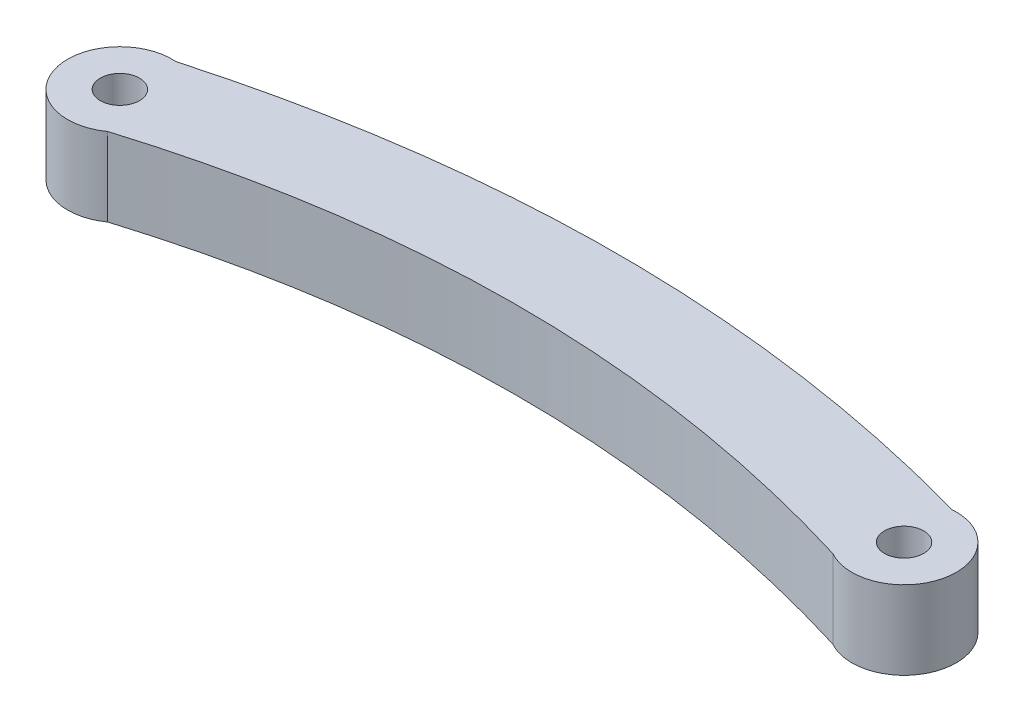
ISO-10303-21;
HEADER;
FILE_DESCRIPTION(('STEP AP214'),'2;1');
FILE_NAME('part.step','',(''),(''),'','','');
FILE_SCHEMA(('AUTOMOTIVE_DESIGN { 1 0 10303 214 1 1 1 1 }'));
ENDSEC;
DATA;
#1=APPLICATION_CONTEXT('core data for automotive mechanical design processes');
#2=APPLICATION_PROTOCOL_DEFINITION('international standard','automotive_design',2000,#1);
#3=PRODUCT_CONTEXT('',#1,'mechanical');
#4=PRODUCT('Part','Part','',(#3));
#5=PRODUCT_RELATED_PRODUCT_CATEGORY('part','',(#4));
#6=PRODUCT_DEFINITION_FORMATION('','',#4);
#7=PRODUCT_DEFINITION_CONTEXT('part definition',#1,'design');
#8=PRODUCT_DEFINITION('design','',#6,#7);
#9=PRODUCT_DEFINITION_SHAPE('','',#8);
#10=(LENGTH_UNIT() NAMED_UNIT(*) SI_UNIT(.MILLI.,.METRE.));
#11=(NAMED_UNIT(*) PLANE_ANGLE_UNIT() SI_UNIT($,.RADIAN.));
#12=(NAMED_UNIT(*) SI_UNIT($,.STERADIAN.) SOLID_ANGLE_UNIT());
#13=UNCERTAINTY_MEASURE_WITH_UNIT(LENGTH_MEASURE(1.E-05),#10,'distance_accuracy_value','');
#14=(GEOMETRIC_REPRESENTATION_CONTEXT(3) GLOBAL_UNCERTAINTY_ASSIGNED_CONTEXT((#13)) GLOBAL_UNIT_ASSIGNED_CONTEXT((#10,
#11,#12)) REPRESENTATION_CONTEXT('',''));
#15=CARTESIAN_POINT('',(0.,0.,0.));
#16=DIRECTION('',(0.,0.,1.));
#17=DIRECTION('',(1.,0.,0.));
#18=AXIS2_PLACEMENT_3D('',#15,#16,#17);
#19=CARTESIAN_POINT('',(-60.,6.,-8.7865889212828));
#20=DIRECTION('',(0.,1.,0.));
#21=DIRECTION('',(0.,0.,1.));
#22=AXIS2_PLACEMENT_3D('',#19,#20,#21);
#23=PLANE('',#22);
#24=CARTESIAN_POINT('',(0.,6.,-8.7865889212828));
#25=DIRECTION('',(0.,-1.,0.));
#26=DIRECTION('',(0.,0.,-1.));
#27=AXIS2_PLACEMENT_3D('',#24,#25,#26);
#28=CIRCLE('',#27,1.5);
#29=CARTESIAN_POINT('',(0.,6.,-10.2865889212828));
#30=VERTEX_POINT('',#29);
#31=EDGE_CURVE('E202',#30,#30,#28,.T.);
#32=ORIENTED_EDGE('',*,*,#31,.T.);
#33=EDGE_LOOP('',(#32));
#34=FACE_BOUND('',#33,.T.);
#35=CARTESIAN_POINT('',(-60.,6.,-8.7865889212828));
#36=DIRECTION('',(0.,1.,0.));
#37=DIRECTION('',(0.,0.,1.));
#38=AXIS2_PLACEMENT_3D('',#35,#36,#37);
#39=CIRCLE('',#38,3.99999999999999);
#40=CARTESIAN_POINT('',(-59.6876381132382,6.,-12.7743740272907));
#41=VERTEX_POINT('',#40);
#42=CARTESIAN_POINT('',(-57.6753223207648,6.,-5.53145855712441));
#43=VERTEX_POINT('',#42);
#44=EDGE_CURVE('E142',#41,#43,#39,.T.);
#45=ORIENTED_EDGE('',*,*,#44,.T.);
#46=CARTESIAN_POINT('',(-57.6753223207648,6.,-5.53145855712441));
#47=CARTESIAN_POINT('',(-48.4502148805752,6.,-8.36821213322583));
#48=CARTESIAN_POINT('',(-29.8850631829615,6.,-11.1079205808767));
#49=CARTESIAN_POINT('',(-11.3199114858871,6.,-8.15994158534279));
#50=CARTESIAN_POINT('',(-1.97986722890945,6.,-5.31094139083751));
#51=B_SPLINE_CURVE_WITH_KNOTS('',3,(#46,#47,#48,#49,#50),.UNSPECIFIED.,.F.,.F.,(4,1,4),
(0.0387446279905169,0.5,0.967002212854647),.UNSPECIFIED.);
#52=CARTESIAN_POINT('',(-1.97986722890944,6.,-5.31094139083753));
#53=VERTEX_POINT('',#52);
#54=EDGE_CURVE('E134',#43,#53,#51,.T.);
#55=ORIENTED_EDGE('',*,*,#54,.T.);
#56=CARTESIAN_POINT('',(0.,6.,-8.7865889212828));
#57=DIRECTION('',(0.,-1.,0.));
#58=DIRECTION('',(0.,0.,-1.));
#59=AXIS2_PLACEMENT_3D('',#56,#57,#58);
#60=CIRCLE('',#59,3.99999999999997);
#61=CARTESIAN_POINT('',(-0.312361886761768,6.,-12.7743740272907));
#62=VERTEX_POINT('',#61);
#63=EDGE_CURVE('E141',#62,#53,#60,.T.);
#64=ORIENTED_EDGE('',*,*,#63,.F.);
#65=CARTESIAN_POINT('',(-59.6876381132382,6.,-12.7743740272907));
#66=CARTESIAN_POINT('',(-49.7917587421588,6.,-15.5409235095828));
#67=CARTESIAN_POINT('',(-29.9999999999999,6.,-18.3074729918749));
#68=CARTESIAN_POINT('',(-10.2082412578413,6.,-15.5409235095828));
#69=CARTESIAN_POINT('',(-0.312361886761768,6.,-12.7743740272907));
#70=B_SPLINE_CURVE_WITH_KNOTS('',3,(#65,#66,#67,#68,#69),.UNSPECIFIED.,.F.,.F.,(4,1,4),
(0.00520603144602852,0.5,0.994793968553973),.UNSPECIFIED.);
#71=EDGE_CURVE('E154',#41,#62,#70,.T.);
#72=ORIENTED_EDGE('',*,*,#71,.F.);
#73=EDGE_LOOP('',(#45,#55,#64,#72));
#74=FACE_BOUND('',#73,.T.);
#75=CARTESIAN_POINT('',(-60.,6.,-8.7865889212828));
#76=DIRECTION('',(0.,1.,0.));
#77=DIRECTION('',(0.,0.,1.));
#78=AXIS2_PLACEMENT_3D('',#75,#76,#77);
#79=CIRCLE('',#78,1.5);
#80=CARTESIAN_POINT('',(-60.,6.,-7.28658892128279));
#81=VERTEX_POINT('',#80);
#82=EDGE_CURVE('E212',#81,#81,#79,.T.);
#83=ORIENTED_EDGE('',*,*,#82,.F.);
#84=EDGE_LOOP('',(#83));
#85=FACE_BOUND('',#84,.T.);
#86=ADVANCED_FACE('F91',(#34,#74,#85),#23,.T.);
#87=CARTESIAN_POINT('',(-60.,0.,-8.7865889212828));
#88=DIRECTION('',(0.,1.,0.));
#89=DIRECTION('',(0.,0.,1.));
#90=AXIS2_PLACEMENT_3D('',#87,#88,#89);
#91=PLANE('',#90);
#92=CARTESIAN_POINT('',(0.,0.,-8.7865889212828));
#93=DIRECTION('',(0.,-1.,0.));
#94=DIRECTION('',(0.,0.,-1.));
#95=AXIS2_PLACEMENT_3D('',#92,#93,#94);
#96=CIRCLE('',#95,1.5);
#97=CARTESIAN_POINT('',(0.,0.,-10.2865889212828));
#98=VERTEX_POINT('',#97);
#99=EDGE_CURVE('E205',#98,#98,#96,.T.);
#100=ORIENTED_EDGE('',*,*,#99,.F.);
#101=EDGE_LOOP('',(#100));
#102=FACE_BOUND('',#101,.T.);
#103=CARTESIAN_POINT('',(-60.,0.,-8.7865889212828));
#104=DIRECTION('',(0.,1.,0.));
#105=DIRECTION('',(0.,0.,1.));
#106=AXIS2_PLACEMENT_3D('',#103,#104,#105);
#107=CIRCLE('',#106,3.99999999999999);
#108=CARTESIAN_POINT('',(-59.6876381132382,0.,-12.7743740272907));
#109=VERTEX_POINT('',#108);
#110=CARTESIAN_POINT('',(-57.6753223207648,0.,-5.53145855712441));
#111=VERTEX_POINT('',#110);
#112=EDGE_CURVE('E166',#109,#111,#107,.T.);
#113=ORIENTED_EDGE('',*,*,#112,.F.);
#114=CARTESIAN_POINT('',(-59.6876381132382,0.,-12.7743740272907));
#115=CARTESIAN_POINT('',(-49.7917587421588,0.,-15.5409235095828));
#116=CARTESIAN_POINT('',(-29.9999999999999,0.,-18.3074729918749));
#117=CARTESIAN_POINT('',(-10.2082412578413,0.,-15.5409235095828));
#118=CARTESIAN_POINT('',(-0.312361886761768,0.,-12.7743740272907));
#119=B_SPLINE_CURVE_WITH_KNOTS('',3,(#114,#115,#116,#117,#118),.UNSPECIFIED.,.F.,.F.,(4,1,4),
(0.00520603144602852,0.5,0.994793968553973),.UNSPECIFIED.);
#120=CARTESIAN_POINT('',(-0.312361886761768,0.,-12.7743740272907));
#121=VERTEX_POINT('',#120);
#122=EDGE_CURVE('E219',#109,#121,#119,.T.);
#123=ORIENTED_EDGE('',*,*,#122,.T.);
#124=CARTESIAN_POINT('',(0.,0.,-8.7865889212828));
#125=DIRECTION('',(0.,-1.,0.));
#126=DIRECTION('',(0.,0.,-1.));
#127=AXIS2_PLACEMENT_3D('',#124,#125,#126);
#128=CIRCLE('',#127,3.99999999999997);
#129=CARTESIAN_POINT('',(-1.97986722890944,0.,-5.31094139083753));
#130=VERTEX_POINT('',#129);
#131=EDGE_CURVE('E222',#121,#130,#128,.T.);
#132=ORIENTED_EDGE('',*,*,#131,.T.);
#133=CARTESIAN_POINT('',(-57.6753223207648,0.,-5.53145855712441));
#134=CARTESIAN_POINT('',(-48.4502148805752,0.,-8.36821213322583));
#135=CARTESIAN_POINT('',(-29.8850631829615,0.,-11.1079205808767));
#136=CARTESIAN_POINT('',(-11.3199114858871,0.,-8.15994158534279));
#137=CARTESIAN_POINT('',(-1.97986722890945,0.,-5.31094139083751));
#138=B_SPLINE_CURVE_WITH_KNOTS('',3,(#133,#134,#135,#136,#137),.UNSPECIFIED.,.F.,.F.,(4,1,4),
(0.0387446279905169,0.5,0.967002212854647),.UNSPECIFIED.);
#139=EDGE_CURVE('E148',#111,#130,#138,.T.);
#140=ORIENTED_EDGE('',*,*,#139,.F.);
#141=EDGE_LOOP('',(#113,#123,#132,#140));
#142=FACE_BOUND('',#141,.T.);
#143=CARTESIAN_POINT('',(-60.,0.,-8.7865889212828));
#144=DIRECTION('',(0.,1.,0.));
#145=DIRECTION('',(0.,0.,1.));
#146=AXIS2_PLACEMENT_3D('',#143,#144,#145);
#147=CIRCLE('',#146,1.5);
#148=CARTESIAN_POINT('',(-60.,0.,-7.28658892128279));
#149=VERTEX_POINT('',#148);
#150=EDGE_CURVE('E209',#149,#149,#147,.T.);
#151=ORIENTED_EDGE('',*,*,#150,.T.);
#152=EDGE_LOOP('',(#151));
#153=FACE_BOUND('',#152,.T.);
#154=ADVANCED_FACE('F177',(#102,#142,#153),#91,.F.);
#155=CARTESIAN_POINT('',(-60.,6.,-8.7865889212828));
#156=DIRECTION('',(0.,-1.,0.));
#157=DIRECTION('',(0.,0.,-1.));
#158=AXIS2_PLACEMENT_3D('',#155,#156,#157);
#159=CYLINDRICAL_SURFACE('',#158,3.99999999999999);
#160=ORIENTED_EDGE('',*,*,#112,.T.);
#161=DIRECTION('',(0.,-1.,0.));
#162=VECTOR('',#161,1.);
#163=CARTESIAN_POINT('',(-57.6753223207648,6.,-5.53145855712441));
#164=LINE('',#163,#162);
#165=EDGE_CURVE('E12',#43,#111,#164,.T.);
#166=ORIENTED_EDGE('',*,*,#165,.F.);
#167=ORIENTED_EDGE('',*,*,#44,.F.);
#168=DIRECTION('',(0.,-1.,0.));
#169=VECTOR('',#168,1.);
#170=CARTESIAN_POINT('',(-59.6876381132382,6.,-12.7743740272907));
#171=LINE('',#170,#169);
#172=EDGE_CURVE('E109',#41,#109,#171,.T.);
#173=ORIENTED_EDGE('',*,*,#172,.T.);
#174=EDGE_LOOP('',(#160,#166,#167,#173));
#175=FACE_BOUND('',#174,.T.);
#176=ADVANCED_FACE('F93',(#175),#159,.T.);
#177=DIRECTION('',(0.,-1.,0.));
#178=VECTOR('',#177,1.);
#179=SURFACE_OF_LINEAR_EXTRUSION('',#51,#178);
#180=ORIENTED_EDGE('',*,*,#139,.T.);
#181=DIRECTION('',(0.,-1.,0.));
#182=VECTOR('',#181,1.);
#183=CARTESIAN_POINT('',(-1.97986722890944,6.,-5.31094139083753));
#184=LINE('',#183,#182);
#185=EDGE_CURVE('E101',#53,#130,#184,.T.);
#186=ORIENTED_EDGE('',*,*,#185,.F.);
#187=ORIENTED_EDGE('',*,*,#54,.F.);
#188=ORIENTED_EDGE('',*,*,#165,.T.);
#189=EDGE_LOOP('',(#180,#186,#187,#188));
#190=FACE_BOUND('',#189,.T.);
#191=ADVANCED_FACE('F147',(#190),#179,.F.);
#192=CARTESIAN_POINT('',(0.,6.,-8.7865889212828));
#193=DIRECTION('',(0.,-1.,0.));
#194=DIRECTION('',(0.,0.,-1.));
#195=AXIS2_PLACEMENT_3D('',#192,#193,#194);
#196=CYLINDRICAL_SURFACE('',#195,3.99999999999997);
#197=ORIENTED_EDGE('',*,*,#131,.F.);
#198=DIRECTION('',(0.,-1.,0.));
#199=VECTOR('',#198,1.);
#200=CARTESIAN_POINT('',(-0.312361886761768,6.,-12.7743740272907));
#201=LINE('',#200,#199);
#202=EDGE_CURVE('E123',#62,#121,#201,.T.);
#203=ORIENTED_EDGE('',*,*,#202,.F.);
#204=ORIENTED_EDGE('',*,*,#63,.T.);
#205=ORIENTED_EDGE('',*,*,#185,.T.);
#206=EDGE_LOOP('',(#197,#203,#204,#205));
#207=FACE_BOUND('',#206,.T.);
#208=ADVANCED_FACE('F152',(#207),#196,.T.);
#209=DIRECTION('',(0.,-1.,0.));
#210=VECTOR('',#209,1.);
#211=SURFACE_OF_LINEAR_EXTRUSION('',#70,#210);
#212=ORIENTED_EDGE('',*,*,#122,.F.);
#213=ORIENTED_EDGE('',*,*,#172,.F.);
#214=ORIENTED_EDGE('',*,*,#71,.T.);
#215=ORIENTED_EDGE('',*,*,#202,.T.);
#216=EDGE_LOOP('',(#212,#213,#214,#215));
#217=FACE_BOUND('',#216,.T.);
#218=ADVANCED_FACE('F172',(#217),#211,.T.);
#219=CARTESIAN_POINT('',(-60.,6.,-8.7865889212828));
#220=DIRECTION('',(0.,-1.,0.));
#221=DIRECTION('',(0.,0.,-1.));
#222=AXIS2_PLACEMENT_3D('',#219,#220,#221);
#223=CYLINDRICAL_SURFACE('',#222,1.5);
#224=ORIENTED_EDGE('',*,*,#82,.T.);
#225=EDGE_LOOP('',(#224));
#226=FACE_BOUND('',#225,.T.);
#227=ORIENTED_EDGE('',*,*,#150,.F.);
#228=EDGE_LOOP('',(#227));
#229=FACE_BOUND('',#228,.T.);
#230=ADVANCED_FACE('F176',(#226,#229),#223,.F.);
#231=CARTESIAN_POINT('',(0.,6.,-8.7865889212828));
#232=DIRECTION('',(0.,-1.,0.));
#233=DIRECTION('',(0.,0.,-1.));
#234=AXIS2_PLACEMENT_3D('',#231,#232,#233);
#235=CYLINDRICAL_SURFACE('',#234,1.5);
#236=ORIENTED_EDGE('',*,*,#31,.F.);
#237=EDGE_LOOP('',(#236));
#238=FACE_BOUND('',#237,.T.);
#239=ORIENTED_EDGE('',*,*,#99,.T.);
#240=EDGE_LOOP('',(#239));
#241=FACE_BOUND('',#240,.T.);
#242=ADVANCED_FACE('F194',(#238,#241),#235,.F.);
#243=CLOSED_SHELL('',(#86,#154,#176,#191,#208,#218,#230,#242));
#244=MANIFOLD_SOLID_BREP('B2',#243);
#245=ADVANCED_BREP_SHAPE_REPRESENTATION('',(#18,#244),#14);
#246=SHAPE_DEFINITION_REPRESENTATION(#9,#245);
ENDSEC;
END-ISO-10303-21;
